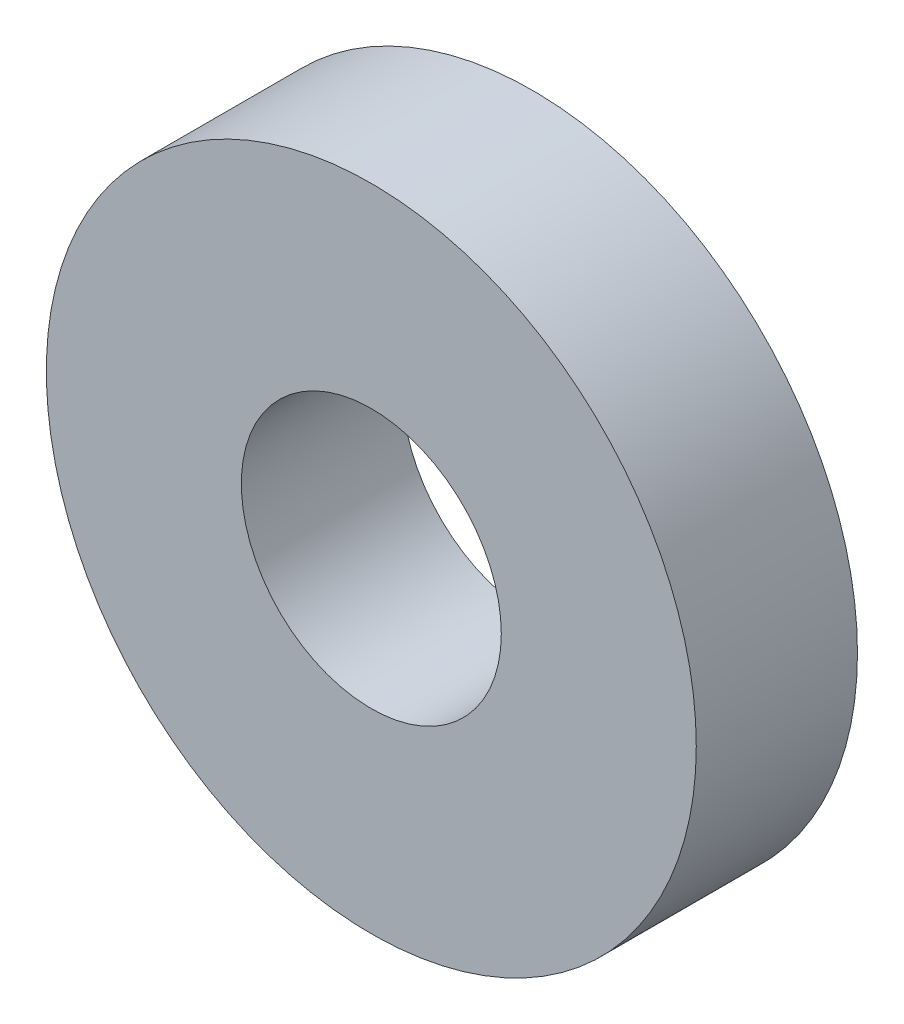
ISO-10303-21;
HEADER;
FILE_DESCRIPTION(('STEP AP214'),'2;1');
FILE_NAME('part.step','',(''),(''),'','','');
FILE_SCHEMA(('AUTOMOTIVE_DESIGN { 1 0 10303 214 1 1 1 1 }'));
ENDSEC;
DATA;
#1=APPLICATION_CONTEXT('core data for automotive mechanical design processes');
#2=APPLICATION_PROTOCOL_DEFINITION('international standard','automotive_design',2000,#1);
#3=PRODUCT_CONTEXT('',#1,'mechanical');
#4=PRODUCT('Part','Part','',(#3));
#5=PRODUCT_RELATED_PRODUCT_CATEGORY('part','',(#4));
#6=PRODUCT_DEFINITION_FORMATION('','',#4);
#7=PRODUCT_DEFINITION_CONTEXT('part definition',#1,'design');
#8=PRODUCT_DEFINITION('design','',#6,#7);
#9=PRODUCT_DEFINITION_SHAPE('','',#8);
#10=(LENGTH_UNIT() NAMED_UNIT(*) SI_UNIT(.MILLI.,.METRE.));
#11=(NAMED_UNIT(*) PLANE_ANGLE_UNIT() SI_UNIT($,.RADIAN.));
#12=(NAMED_UNIT(*) SI_UNIT($,.STERADIAN.) SOLID_ANGLE_UNIT());
#13=UNCERTAINTY_MEASURE_WITH_UNIT(LENGTH_MEASURE(1.E-05),#10,'distance_accuracy_value','');
#14=(GEOMETRIC_REPRESENTATION_CONTEXT(3) GLOBAL_UNCERTAINTY_ASSIGNED_CONTEXT((#13)) GLOBAL_UNIT_ASSIGNED_CONTEXT((#10,
#11,#12)) REPRESENTATION_CONTEXT('',''));
#15=CARTESIAN_POINT('',(0.,0.,0.));
#16=DIRECTION('',(0.,0.,1.));
#17=DIRECTION('',(1.,0.,0.));
#18=AXIS2_PLACEMENT_3D('',#15,#16,#17);
#19=CARTESIAN_POINT('',(0.,0.,3.937));
#20=DIRECTION('',(0.,0.,1.));
#21=DIRECTION('',(1.,0.,0.));
#22=AXIS2_PLACEMENT_3D('',#19,#20,#21);
#23=PLANE('',#22);
#24=CARTESIAN_POINT('',(0.,0.,3.937));
#25=DIRECTION('',(0.,0.,1.));
#26=DIRECTION('',(1.,0.,0.));
#27=AXIS2_PLACEMENT_3D('',#24,#25,#26);
#28=CIRCLE('',#27,15.875);
#29=CARTESIAN_POINT('',(15.875,0.,3.937));
#30=VERTEX_POINT('',#29);
#31=EDGE_CURVE('E10',#30,#30,#28,.T.);
#32=ORIENTED_EDGE('',*,*,#31,.T.);
#33=EDGE_LOOP('',(#32));
#34=FACE_BOUND('',#33,.T.);
#35=CARTESIAN_POINT('',(0.,0.,3.937));
#36=DIRECTION('',(0.,0.,1.));
#37=DIRECTION('',(1.,0.,0.));
#38=AXIS2_PLACEMENT_3D('',#35,#36,#37);
#39=CIRCLE('',#38,6.35);
#40=CARTESIAN_POINT('',(6.35,0.,3.937));
#41=VERTEX_POINT('',#40);
#42=EDGE_CURVE('E42',#41,#41,#39,.T.);
#43=ORIENTED_EDGE('',*,*,#42,.F.);
#44=EDGE_LOOP('',(#43));
#45=FACE_BOUND('',#44,.T.);
#46=ADVANCED_FACE('F31',(#34,#45),#23,.T.);
#47=CARTESIAN_POINT('',(0.,0.,-3.937));
#48=DIRECTION('',(0.,0.,1.));
#49=DIRECTION('',(1.,0.,0.));
#50=AXIS2_PLACEMENT_3D('',#47,#48,#49);
#51=PLANE('',#50);
#52=CARTESIAN_POINT('',(0.,0.,-3.937));
#53=DIRECTION('',(0.,0.,1.));
#54=DIRECTION('',(1.,0.,0.));
#55=AXIS2_PLACEMENT_3D('',#52,#53,#54);
#56=CIRCLE('',#55,15.875);
#57=CARTESIAN_POINT('',(15.875,0.,-3.937));
#58=VERTEX_POINT('',#57);
#59=EDGE_CURVE('E35',#58,#58,#56,.T.);
#60=ORIENTED_EDGE('',*,*,#59,.F.);
#61=EDGE_LOOP('',(#60));
#62=FACE_BOUND('',#61,.T.);
#63=CARTESIAN_POINT('',(0.,0.,-3.937));
#64=DIRECTION('',(0.,0.,1.));
#65=DIRECTION('',(1.,0.,0.));
#66=AXIS2_PLACEMENT_3D('',#63,#64,#65);
#67=CIRCLE('',#66,6.35);
#68=CARTESIAN_POINT('',(6.35,0.,-3.937));
#69=VERTEX_POINT('',#68);
#70=EDGE_CURVE('E44',#69,#69,#67,.T.);
#71=ORIENTED_EDGE('',*,*,#70,.T.);
#72=EDGE_LOOP('',(#71));
#73=FACE_BOUND('',#72,.T.);
#74=ADVANCED_FACE('F54',(#62,#73),#51,.F.);
#75=CARTESIAN_POINT('',(0.,0.,3.937));
#76=DIRECTION('',(0.,0.,-1.));
#77=DIRECTION('',(-1.,0.,0.));
#78=AXIS2_PLACEMENT_3D('',#75,#76,#77);
#79=CYLINDRICAL_SURFACE('',#78,15.875);
#80=ORIENTED_EDGE('',*,*,#31,.F.);
#81=EDGE_LOOP('',(#80));
#82=FACE_BOUND('',#81,.T.);
#83=ORIENTED_EDGE('',*,*,#59,.T.);
#84=EDGE_LOOP('',(#83));
#85=FACE_BOUND('',#84,.T.);
#86=ADVANCED_FACE('F33',(#82,#85),#79,.T.);
#87=CARTESIAN_POINT('',(0.,0.,3.937));
#88=DIRECTION('',(0.,0.,-1.));
#89=DIRECTION('',(-1.,0.,0.));
#90=AXIS2_PLACEMENT_3D('',#87,#88,#89);
#91=CYLINDRICAL_SURFACE('',#90,6.35);
#92=ORIENTED_EDGE('',*,*,#42,.T.);
#93=EDGE_LOOP('',(#92));
#94=FACE_BOUND('',#93,.T.);
#95=ORIENTED_EDGE('',*,*,#70,.F.);
#96=EDGE_LOOP('',(#95));
#97=FACE_BOUND('',#96,.T.);
#98=ADVANCED_FACE('F50',(#94,#97),#91,.F.);
#99=CLOSED_SHELL('',(#46,#74,#86,#98));
#100=MANIFOLD_SOLID_BREP('B2',#99);
#101=ADVANCED_BREP_SHAPE_REPRESENTATION('',(#18,#100),#14);
#102=SHAPE_DEFINITION_REPRESENTATION(#9,#101);
ENDSEC;
END-ISO-10303-21;
